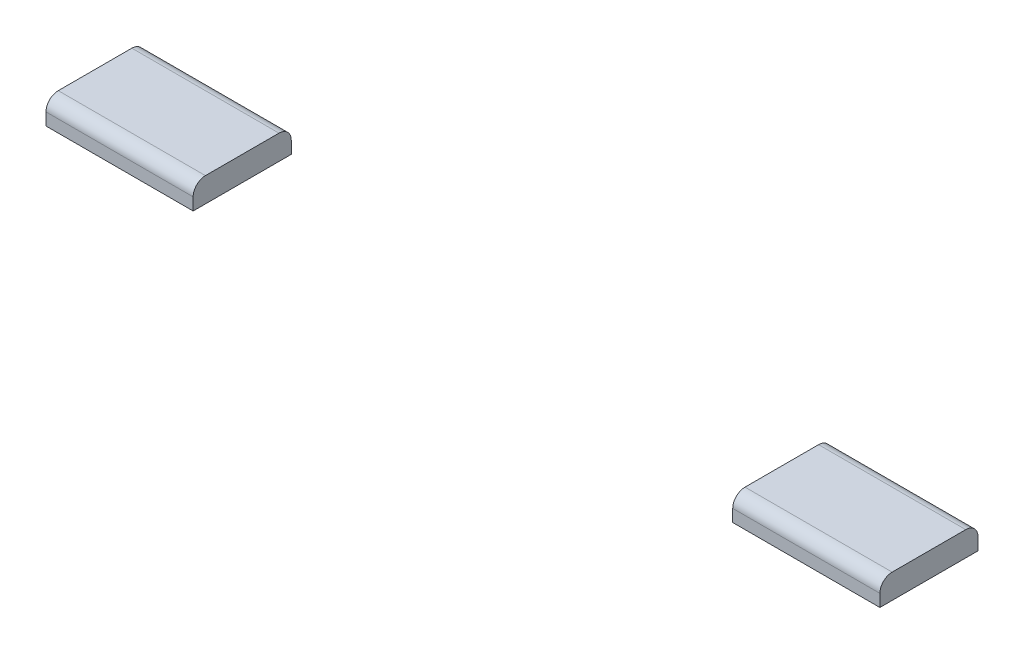
ISO-10303-21;
HEADER;
FILE_DESCRIPTION(('STEP AP214'),'2;1');
FILE_NAME('part.step','',(''),(''),'','','');
FILE_SCHEMA(('AUTOMOTIVE_DESIGN { 1 0 10303 214 1 1 1 1 }'));
ENDSEC;
DATA;
#1=APPLICATION_CONTEXT('core data for automotive mechanical design processes');
#2=APPLICATION_PROTOCOL_DEFINITION('international standard','automotive_design',2000,#1);
#3=PRODUCT_CONTEXT('',#1,'mechanical');
#4=PRODUCT('Part','Part','',(#3));
#5=PRODUCT_RELATED_PRODUCT_CATEGORY('part','',(#4));
#6=PRODUCT_DEFINITION_FORMATION('','',#4);
#7=PRODUCT_DEFINITION_CONTEXT('part definition',#1,'design');
#8=PRODUCT_DEFINITION('design','',#6,#7);
#9=PRODUCT_DEFINITION_SHAPE('','',#8);
#10=(LENGTH_UNIT() NAMED_UNIT(*) SI_UNIT(.MILLI.,.METRE.));
#11=(NAMED_UNIT(*) PLANE_ANGLE_UNIT() SI_UNIT($,.RADIAN.));
#12=(NAMED_UNIT(*) SI_UNIT($,.STERADIAN.) SOLID_ANGLE_UNIT());
#13=UNCERTAINTY_MEASURE_WITH_UNIT(LENGTH_MEASURE(1.E-05),#10,'distance_accuracy_value','');
#14=(GEOMETRIC_REPRESENTATION_CONTEXT(3) GLOBAL_UNCERTAINTY_ASSIGNED_CONTEXT((#13)) GLOBAL_UNIT_ASSIGNED_CONTEXT((#10,
#11,#12)) REPRESENTATION_CONTEXT('',''));
#15=CARTESIAN_POINT('',(0.,0.,0.));
#16=DIRECTION('',(0.,0.,1.));
#17=DIRECTION('',(1.,0.,0.));
#18=AXIS2_PLACEMENT_3D('',#15,#16,#17);
#19=CARTESIAN_POINT('',(0.,6.35,0.));
#20=DIRECTION('',(0.,0.,-1.));
#21=DIRECTION('',(-1.,0.,0.));
#22=AXIS2_PLACEMENT_3D('',#19,#20,#21);
#23=PLANE('',#22);
#24=DIRECTION('',(1.,0.,0.));
#25=VECTOR('',#24,1.);
#26=CARTESIAN_POINT('',(0.,0.,0.));
#27=LINE('',#26,#25);
#28=CARTESIAN_POINT('',(0.,0.,0.));
#29=VERTEX_POINT('',#28);
#30=CARTESIAN_POINT('',(38.1,0.,0.));
#31=VERTEX_POINT('',#30);
#32=EDGE_CURVE('E45',#29,#31,#27,.T.);
#33=ORIENTED_EDGE('',*,*,#32,.T.);
#34=DIRECTION('',(0.,-1.,0.));
#35=VECTOR('',#34,1.);
#36=CARTESIAN_POINT('',(38.1,6.35,0.));
#37=LINE('',#36,#35);
#38=CARTESIAN_POINT('',(38.1,3.175,0.));
#39=VERTEX_POINT('',#38);
#40=EDGE_CURVE('E51',#39,#31,#37,.T.);
#41=ORIENTED_EDGE('',*,*,#40,.F.);
#42=DIRECTION('',(1.,0.,0.));
#43=VECTOR('',#42,1.);
#44=CARTESIAN_POINT('',(0.,3.175,0.));
#45=LINE('',#44,#43);
#46=CARTESIAN_POINT('',(0.,3.175,0.));
#47=VERTEX_POINT('',#46);
#48=EDGE_CURVE('E94',#39,#47,#45,.F.);
#49=ORIENTED_EDGE('',*,*,#48,.T.);
#50=DIRECTION('',(0.,-1.,0.));
#51=VECTOR('',#50,1.);
#52=CARTESIAN_POINT('',(0.,6.35,0.));
#53=LINE('',#52,#51);
#54=EDGE_CURVE('E93',#47,#29,#53,.T.);
#55=ORIENTED_EDGE('',*,*,#54,.T.);
#56=EDGE_LOOP('',(#33,#41,#49,#55));
#57=FACE_BOUND('',#56,.T.);
#58=ADVANCED_FACE('F42',(#57),#23,.F.);
#59=CARTESIAN_POINT('',(0.,6.35,-25.4));
#60=DIRECTION('',(0.,0.,1.));
#61=DIRECTION('',(1.,0.,0.));
#62=AXIS2_PLACEMENT_3D('',#59,#60,#61);
#63=PLANE('',#62);
#64=DIRECTION('',(-1.,0.,0.));
#65=VECTOR('',#64,1.);
#66=CARTESIAN_POINT('',(0.,3.175,-25.4));
#67=LINE('',#66,#65);
#68=CARTESIAN_POINT('',(0.,3.175,-25.4));
#69=VERTEX_POINT('',#68);
#70=CARTESIAN_POINT('',(38.1,3.175,-25.4));
#71=VERTEX_POINT('',#70);
#72=EDGE_CURVE('E97',#69,#71,#67,.F.);
#73=ORIENTED_EDGE('',*,*,#72,.T.);
#74=DIRECTION('',(0.,-1.,0.));
#75=VECTOR('',#74,1.);
#76=CARTESIAN_POINT('',(38.1,6.35,-25.4));
#77=LINE('',#76,#75);
#78=CARTESIAN_POINT('',(38.1,0.,-25.4));
#79=VERTEX_POINT('',#78);
#80=EDGE_CURVE('E58',#71,#79,#77,.T.);
#81=ORIENTED_EDGE('',*,*,#80,.T.);
#82=DIRECTION('',(-1.,0.,0.));
#83=VECTOR('',#82,1.);
#84=CARTESIAN_POINT('',(0.,0.,-25.4));
#85=LINE('',#84,#83);
#86=CARTESIAN_POINT('',(0.,0.,-25.4));
#87=VERTEX_POINT('',#86);
#88=EDGE_CURVE('E90',#79,#87,#85,.T.);
#89=ORIENTED_EDGE('',*,*,#88,.T.);
#90=DIRECTION('',(0.,-1.,0.));
#91=VECTOR('',#90,1.);
#92=CARTESIAN_POINT('',(0.,6.35,-25.4));
#93=LINE('',#92,#91);
#94=EDGE_CURVE('E124',#69,#87,#93,.T.);
#95=ORIENTED_EDGE('',*,*,#94,.F.);
#96=EDGE_LOOP('',(#73,#81,#89,#95));
#97=FACE_BOUND('',#96,.T.);
#98=ADVANCED_FACE('F140',(#97),#63,.F.);
#99=CARTESIAN_POINT('',(0.,6.35,0.));
#100=DIRECTION('',(0.,-1.,0.));
#101=DIRECTION('',(0.,0.,-1.));
#102=AXIS2_PLACEMENT_3D('',#99,#100,#101);
#103=PLANE('',#102);
#104=DIRECTION('',(1.,0.,0.));
#105=VECTOR('',#104,1.);
#106=CARTESIAN_POINT('',(0.,6.35,-3.175));
#107=LINE('',#106,#105);
#108=CARTESIAN_POINT('',(0.,6.35,-3.175));
#109=VERTEX_POINT('',#108);
#110=CARTESIAN_POINT('',(38.1,6.35,-3.175));
#111=VERTEX_POINT('',#110);
#112=EDGE_CURVE('E108',#109,#111,#107,.T.);
#113=ORIENTED_EDGE('',*,*,#112,.T.);
#114=DIRECTION('',(0.,0.,-1.));
#115=VECTOR('',#114,1.);
#116=CARTESIAN_POINT('',(38.1,6.35,0.));
#117=LINE('',#116,#115);
#118=CARTESIAN_POINT('',(38.1,6.35,-22.225));
#119=VERTEX_POINT('',#118);
#120=EDGE_CURVE('E101',#111,#119,#117,.T.);
#121=ORIENTED_EDGE('',*,*,#120,.T.);
#122=DIRECTION('',(-1.,0.,0.));
#123=VECTOR('',#122,1.);
#124=CARTESIAN_POINT('',(0.,6.35,-22.225));
#125=LINE('',#124,#123);
#126=CARTESIAN_POINT('',(0.,6.35,-22.225));
#127=VERTEX_POINT('',#126);
#128=EDGE_CURVE('E104',#119,#127,#125,.T.);
#129=ORIENTED_EDGE('',*,*,#128,.T.);
#130=DIRECTION('',(0.,0.,1.));
#131=VECTOR('',#130,1.);
#132=CARTESIAN_POINT('',(0.,6.35,0.));
#133=LINE('',#132,#131);
#134=EDGE_CURVE('E107',#127,#109,#133,.T.);
#135=ORIENTED_EDGE('',*,*,#134,.T.);
#136=EDGE_LOOP('',(#113,#121,#129,#135));
#137=FACE_BOUND('',#136,.T.);
#138=ADVANCED_FACE('F144',(#137),#103,.F.);
#139=CARTESIAN_POINT('',(0.,0.,0.));
#140=DIRECTION('',(0.,-1.,0.));
#141=DIRECTION('',(0.,0.,-1.));
#142=AXIS2_PLACEMENT_3D('',#139,#140,#141);
#143=PLANE('',#142);
#144=DIRECTION('',(0.,0.,-1.));
#145=VECTOR('',#144,1.);
#146=CARTESIAN_POINT('',(38.1,0.,0.));
#147=LINE('',#146,#145);
#148=EDGE_CURVE('E12',#31,#79,#147,.T.);
#149=ORIENTED_EDGE('',*,*,#148,.F.);
#150=ORIENTED_EDGE('',*,*,#32,.F.);
#151=DIRECTION('',(0.,0.,1.));
#152=VECTOR('',#151,1.);
#153=CARTESIAN_POINT('',(0.,0.,0.));
#154=LINE('',#153,#152);
#155=EDGE_CURVE('E122',#87,#29,#154,.T.);
#156=ORIENTED_EDGE('',*,*,#155,.F.);
#157=ORIENTED_EDGE('',*,*,#88,.F.);
#158=EDGE_LOOP('',(#149,#150,#156,#157));
#159=FACE_BOUND('',#158,.T.);
#160=ADVANCED_FACE('F86',(#159),#143,.T.);
#161=CARTESIAN_POINT('',(0.,3.175,-22.225));
#162=DIRECTION('',(-1.,0.,0.));
#163=DIRECTION('',(0.,0.,1.));
#164=AXIS2_PLACEMENT_3D('',#161,#162,#163);
#165=CYLINDRICAL_SURFACE('',#164,3.175);
#166=CARTESIAN_POINT('',(38.1,3.175,-22.225));
#167=DIRECTION('',(-1.,0.,0.));
#168=DIRECTION('',(0.,0.,1.));
#169=AXIS2_PLACEMENT_3D('',#166,#167,#168);
#170=CIRCLE('',#169,3.175);
#171=EDGE_CURVE('E116',#71,#119,#170,.F.);
#172=ORIENTED_EDGE('',*,*,#171,.F.);
#173=ORIENTED_EDGE('',*,*,#72,.F.);
#174=CARTESIAN_POINT('',(0.,3.175,-22.225));
#175=DIRECTION('',(1.,0.,0.));
#176=DIRECTION('',(0.,0.,-1.));
#177=AXIS2_PLACEMENT_3D('',#174,#175,#176);
#178=CIRCLE('',#177,3.175);
#179=EDGE_CURVE('E121',#127,#69,#178,.F.);
#180=ORIENTED_EDGE('',*,*,#179,.F.);
#181=ORIENTED_EDGE('',*,*,#128,.F.);
#182=EDGE_LOOP('',(#172,#173,#180,#181));
#183=FACE_BOUND('',#182,.T.);
#184=ADVANCED_FACE('F141',(#183),#165,.T.);
#185=CARTESIAN_POINT('',(0.,3.175,-3.175));
#186=DIRECTION('',(1.,0.,0.));
#187=DIRECTION('',(0.,0.,-1.));
#188=AXIS2_PLACEMENT_3D('',#185,#186,#187);
#189=CYLINDRICAL_SURFACE('',#188,3.175);
#190=CARTESIAN_POINT('',(38.1,3.175,-3.175));
#191=DIRECTION('',(-1.,0.,0.));
#192=DIRECTION('',(0.,0.,1.));
#193=AXIS2_PLACEMENT_3D('',#190,#191,#192);
#194=CIRCLE('',#193,3.175);
#195=EDGE_CURVE('E77',#111,#39,#194,.F.);
#196=ORIENTED_EDGE('',*,*,#195,.F.);
#197=ORIENTED_EDGE('',*,*,#112,.F.);
#198=CARTESIAN_POINT('',(0.,3.175,-3.175));
#199=DIRECTION('',(1.,0.,0.));
#200=DIRECTION('',(0.,0.,-1.));
#201=AXIS2_PLACEMENT_3D('',#198,#199,#200);
#202=CIRCLE('',#201,3.175);
#203=EDGE_CURVE('E118',#47,#109,#202,.F.);
#204=ORIENTED_EDGE('',*,*,#203,.F.);
#205=ORIENTED_EDGE('',*,*,#48,.F.);
#206=EDGE_LOOP('',(#196,#197,#204,#205));
#207=FACE_BOUND('',#206,.T.);
#208=ADVANCED_FACE('F149',(#207),#189,.T.);
#209=CARTESIAN_POINT('',(0.,6.35,0.));
#210=DIRECTION('',(1.,0.,0.));
#211=DIRECTION('',(0.,0.,-1.));
#212=AXIS2_PLACEMENT_3D('',#209,#210,#211);
#213=PLANE('',#212);
#214=ORIENTED_EDGE('',*,*,#134,.F.);
#215=ORIENTED_EDGE('',*,*,#179,.T.);
#216=ORIENTED_EDGE('',*,*,#94,.T.);
#217=ORIENTED_EDGE('',*,*,#155,.T.);
#218=ORIENTED_EDGE('',*,*,#54,.F.);
#219=ORIENTED_EDGE('',*,*,#203,.T.);
#220=EDGE_LOOP('',(#214,#215,#216,#217,#218,#219));
#221=FACE_BOUND('',#220,.T.);
#222=ADVANCED_FACE('F134',(#221),#213,.F.);
#223=CARTESIAN_POINT('',(38.1,6.35,0.));
#224=DIRECTION('',(-1.,0.,0.));
#225=DIRECTION('',(0.,0.,1.));
#226=AXIS2_PLACEMENT_3D('',#223,#224,#225);
#227=PLANE('',#226);
#228=ORIENTED_EDGE('',*,*,#171,.T.);
#229=ORIENTED_EDGE('',*,*,#120,.F.);
#230=ORIENTED_EDGE('',*,*,#195,.T.);
#231=ORIENTED_EDGE('',*,*,#40,.T.);
#232=ORIENTED_EDGE('',*,*,#148,.T.);
#233=ORIENTED_EDGE('',*,*,#80,.F.);
#234=EDGE_LOOP('',(#228,#229,#230,#231,#232,#233));
#235=FACE_BOUND('',#234,.T.);
#236=ADVANCED_FACE('F74',(#235),#227,.F.);
#237=CLOSED_SHELL('',(#58,#98,#138,#160,#184,#208,#222,#236));
#238=MANIFOLD_SOLID_BREP('B2',#237);
#239=CARTESIAN_POINT('',(215.9,6.35,0.));
#240=DIRECTION('',(-1.,0.,0.));
#241=DIRECTION('',(0.,0.,1.));
#242=AXIS2_PLACEMENT_3D('',#239,#240,#241);
#243=PLANE('',#242);
#244=DIRECTION('',(0.,-1.,0.));
#245=VECTOR('',#244,1.);
#246=CARTESIAN_POINT('',(215.9,6.35,-25.4));
#247=LINE('',#246,#245);
#248=CARTESIAN_POINT('',(215.9,3.175,-25.4));
#249=VERTEX_POINT('',#248);
#250=CARTESIAN_POINT('',(215.9,0.,-25.4));
#251=VERTEX_POINT('',#250);
#252=EDGE_CURVE('E290',#249,#251,#247,.T.);
#253=ORIENTED_EDGE('',*,*,#252,.F.);
#254=CARTESIAN_POINT('',(215.9,3.175,-22.225));
#255=DIRECTION('',(-1.,0.,0.));
#256=DIRECTION('',(0.,0.,1.));
#257=AXIS2_PLACEMENT_3D('',#254,#255,#256);
#258=CIRCLE('',#257,3.175);
#259=CARTESIAN_POINT('',(215.9,6.35,-22.225));
#260=VERTEX_POINT('',#259);
#261=EDGE_CURVE('E311',#249,#260,#258,.F.);
#262=ORIENTED_EDGE('',*,*,#261,.T.);
#263=DIRECTION('',(0.,0.,-1.));
#264=VECTOR('',#263,1.);
#265=CARTESIAN_POINT('',(215.9,6.35,0.));
#266=LINE('',#265,#264);
#267=CARTESIAN_POINT('',(215.9,6.35,-3.175));
#268=VERTEX_POINT('',#267);
#269=EDGE_CURVE('E292',#268,#260,#266,.T.);
#270=ORIENTED_EDGE('',*,*,#269,.F.);
#271=CARTESIAN_POINT('',(215.9,3.175,-3.175));
#272=DIRECTION('',(-1.,0.,0.));
#273=DIRECTION('',(0.,0.,1.));
#274=AXIS2_PLACEMENT_3D('',#271,#272,#273);
#275=CIRCLE('',#274,3.175);
#276=CARTESIAN_POINT('',(215.9,3.175,0.));
#277=VERTEX_POINT('',#276);
#278=EDGE_CURVE('E239',#268,#277,#275,.F.);
#279=ORIENTED_EDGE('',*,*,#278,.T.);
#280=DIRECTION('',(0.,-1.,0.));
#281=VECTOR('',#280,1.);
#282=CARTESIAN_POINT('',(215.9,6.35,0.));
#283=LINE('',#282,#281);
#284=CARTESIAN_POINT('',(215.9,0.,0.));
#285=VERTEX_POINT('',#284);
#286=EDGE_CURVE('E301',#277,#285,#283,.T.);
#287=ORIENTED_EDGE('',*,*,#286,.T.);
#288=DIRECTION('',(0.,0.,-1.));
#289=VECTOR('',#288,1.);
#290=CARTESIAN_POINT('',(215.9,0.,0.));
#291=LINE('',#290,#289);
#292=EDGE_CURVE('E293',#285,#251,#291,.T.);
#293=ORIENTED_EDGE('',*,*,#292,.T.);
#294=EDGE_LOOP('',(#253,#262,#270,#279,#287,#293));
#295=FACE_BOUND('',#294,.T.);
#296=ADVANCED_FACE('F217',(#295),#243,.F.);
#297=CARTESIAN_POINT('',(0.,3.175,-3.175));
#298=DIRECTION('',(1.,0.,0.));
#299=DIRECTION('',(0.,0.,-1.));
#300=AXIS2_PLACEMENT_3D('',#297,#298,#299);
#301=CYLINDRICAL_SURFACE('',#300,3.175);
#302=CARTESIAN_POINT('',(177.8,3.175,-3.175));
#303=DIRECTION('',(1.,0.,0.));
#304=DIRECTION('',(0.,0.,-1.));
#305=AXIS2_PLACEMENT_3D('',#302,#303,#304);
#306=CIRCLE('',#305,3.175);
#307=CARTESIAN_POINT('',(177.8,3.175,0.));
#308=VERTEX_POINT('',#307);
#309=CARTESIAN_POINT('',(177.8,6.35,-3.175));
#310=VERTEX_POINT('',#309);
#311=EDGE_CURVE('E40',#308,#310,#306,.F.);
#312=ORIENTED_EDGE('',*,*,#311,.F.);
#313=DIRECTION('',(1.,0.,0.));
#314=VECTOR('',#313,1.);
#315=CARTESIAN_POINT('',(0.,3.175,0.));
#316=LINE('',#315,#314);
#317=EDGE_CURVE('E225',#277,#308,#316,.F.);
#318=ORIENTED_EDGE('',*,*,#317,.F.);
#319=ORIENTED_EDGE('',*,*,#278,.F.);
#320=DIRECTION('',(1.,0.,0.));
#321=VECTOR('',#320,1.);
#322=CARTESIAN_POINT('',(0.,6.35,-3.175));
#323=LINE('',#322,#321);
#324=EDGE_CURVE('E303',#310,#268,#323,.T.);
#325=ORIENTED_EDGE('',*,*,#324,.F.);
#326=EDGE_LOOP('',(#312,#318,#319,#325));
#327=FACE_BOUND('',#326,.T.);
#328=ADVANCED_FACE('F219',(#327),#301,.T.);
#329=CARTESIAN_POINT('',(0.,3.175,-22.225));
#330=DIRECTION('',(-1.,0.,0.));
#331=DIRECTION('',(0.,0.,1.));
#332=AXIS2_PLACEMENT_3D('',#329,#330,#331);
#333=CYLINDRICAL_SURFACE('',#332,3.175);
#334=CARTESIAN_POINT('',(177.8,3.175,-22.225));
#335=DIRECTION('',(1.,0.,0.));
#336=DIRECTION('',(0.,0.,-1.));
#337=AXIS2_PLACEMENT_3D('',#334,#335,#336);
#338=CIRCLE('',#337,3.175);
#339=CARTESIAN_POINT('',(177.8,6.35,-22.225));
#340=VERTEX_POINT('',#339);
#341=CARTESIAN_POINT('',(177.8,3.175,-25.4));
#342=VERTEX_POINT('',#341);
#343=EDGE_CURVE('E274',#340,#342,#338,.F.);
#344=ORIENTED_EDGE('',*,*,#343,.F.);
#345=DIRECTION('',(-1.,0.,0.));
#346=VECTOR('',#345,1.);
#347=CARTESIAN_POINT('',(0.,6.35,-22.225));
#348=LINE('',#347,#346);
#349=EDGE_CURVE('E305',#260,#340,#348,.T.);
#350=ORIENTED_EDGE('',*,*,#349,.F.);
#351=ORIENTED_EDGE('',*,*,#261,.F.);
#352=DIRECTION('',(-1.,0.,0.));
#353=VECTOR('',#352,1.);
#354=CARTESIAN_POINT('',(0.,3.175,-25.4));
#355=LINE('',#354,#353);
#356=EDGE_CURVE('E308',#342,#249,#355,.F.);
#357=ORIENTED_EDGE('',*,*,#356,.F.);
#358=EDGE_LOOP('',(#344,#350,#351,#357));
#359=FACE_BOUND('',#358,.T.);
#360=ADVANCED_FACE('F327',(#359),#333,.T.);
#361=CARTESIAN_POINT('',(0.,6.35,0.));
#362=DIRECTION('',(0.,-1.,0.));
#363=DIRECTION('',(0.,0.,-1.));
#364=AXIS2_PLACEMENT_3D('',#361,#362,#363);
#365=PLANE('',#364);
#366=ORIENTED_EDGE('',*,*,#349,.T.);
#367=DIRECTION('',(0.,0.,1.));
#368=VECTOR('',#367,1.);
#369=CARTESIAN_POINT('',(177.8,6.35,0.));
#370=LINE('',#369,#368);
#371=EDGE_CURVE('E278',#340,#310,#370,.T.);
#372=ORIENTED_EDGE('',*,*,#371,.T.);
#373=ORIENTED_EDGE('',*,*,#324,.T.);
#374=ORIENTED_EDGE('',*,*,#269,.T.);
#375=EDGE_LOOP('',(#366,#372,#373,#374));
#376=FACE_BOUND('',#375,.T.);
#377=ADVANCED_FACE('F320',(#376),#365,.F.);
#378=CARTESIAN_POINT('',(0.,0.,0.));
#379=DIRECTION('',(0.,-1.,0.));
#380=DIRECTION('',(0.,0.,-1.));
#381=AXIS2_PLACEMENT_3D('',#378,#379,#380);
#382=PLANE('',#381);
#383=DIRECTION('',(0.,0.,1.));
#384=VECTOR('',#383,1.);
#385=CARTESIAN_POINT('',(177.8,0.,0.));
#386=LINE('',#385,#384);
#387=CARTESIAN_POINT('',(177.8,0.,-25.4));
#388=VERTEX_POINT('',#387);
#389=CARTESIAN_POINT('',(177.8,0.,0.));
#390=VERTEX_POINT('',#389);
#391=EDGE_CURVE('E272',#388,#390,#386,.T.);
#392=ORIENTED_EDGE('',*,*,#391,.F.);
#393=DIRECTION('',(-1.,0.,0.));
#394=VECTOR('',#393,1.);
#395=CARTESIAN_POINT('',(0.,0.,-25.4));
#396=LINE('',#395,#394);
#397=EDGE_CURVE('E285',#251,#388,#396,.T.);
#398=ORIENTED_EDGE('',*,*,#397,.F.);
#399=ORIENTED_EDGE('',*,*,#292,.F.);
#400=DIRECTION('',(1.,0.,0.));
#401=VECTOR('',#400,1.);
#402=CARTESIAN_POINT('',(0.,0.,0.));
#403=LINE('',#402,#401);
#404=EDGE_CURVE('E286',#390,#285,#403,.T.);
#405=ORIENTED_EDGE('',*,*,#404,.F.);
#406=EDGE_LOOP('',(#392,#398,#399,#405));
#407=FACE_BOUND('',#406,.T.);
#408=ADVANCED_FACE('F283',(#407),#382,.T.);
#409=CARTESIAN_POINT('',(0.,6.35,-25.4));
#410=DIRECTION('',(0.,0.,1.));
#411=DIRECTION('',(1.,0.,0.));
#412=AXIS2_PLACEMENT_3D('',#409,#410,#411);
#413=PLANE('',#412);
#414=ORIENTED_EDGE('',*,*,#397,.T.);
#415=DIRECTION('',(0.,-1.,0.));
#416=VECTOR('',#415,1.);
#417=CARTESIAN_POINT('',(177.8,6.35,-25.4));
#418=LINE('',#417,#416);
#419=EDGE_CURVE('E269',#342,#388,#418,.T.);
#420=ORIENTED_EDGE('',*,*,#419,.F.);
#421=ORIENTED_EDGE('',*,*,#356,.T.);
#422=ORIENTED_EDGE('',*,*,#252,.T.);
#423=EDGE_LOOP('',(#414,#420,#421,#422));
#424=FACE_BOUND('',#423,.T.);
#425=ADVANCED_FACE('F288',(#424),#413,.F.);
#426=CARTESIAN_POINT('',(0.,6.35,0.));
#427=DIRECTION('',(0.,0.,-1.));
#428=DIRECTION('',(-1.,0.,0.));
#429=AXIS2_PLACEMENT_3D('',#426,#427,#428);
#430=PLANE('',#429);
#431=ORIENTED_EDGE('',*,*,#317,.T.);
#432=DIRECTION('',(0.,-1.,0.));
#433=VECTOR('',#432,1.);
#434=CARTESIAN_POINT('',(177.8,6.35,0.));
#435=LINE('',#434,#433);
#436=EDGE_CURVE('E231',#308,#390,#435,.T.);
#437=ORIENTED_EDGE('',*,*,#436,.T.);
#438=ORIENTED_EDGE('',*,*,#404,.T.);
#439=ORIENTED_EDGE('',*,*,#286,.F.);
#440=EDGE_LOOP('',(#431,#437,#438,#439));
#441=FACE_BOUND('',#440,.T.);
#442=ADVANCED_FACE('F315',(#441),#430,.F.);
#443=CARTESIAN_POINT('',(177.8,6.35,0.));
#444=DIRECTION('',(1.,0.,0.));
#445=DIRECTION('',(0.,0.,-1.));
#446=AXIS2_PLACEMENT_3D('',#443,#444,#445);
#447=PLANE('',#446);
#448=ORIENTED_EDGE('',*,*,#343,.T.);
#449=ORIENTED_EDGE('',*,*,#419,.T.);
#450=ORIENTED_EDGE('',*,*,#391,.T.);
#451=ORIENTED_EDGE('',*,*,#436,.F.);
#452=ORIENTED_EDGE('',*,*,#311,.T.);
#453=ORIENTED_EDGE('',*,*,#371,.F.);
#454=EDGE_LOOP('',(#448,#449,#450,#451,#452,#453));
#455=FACE_BOUND('',#454,.T.);
#456=ADVANCED_FACE('F271',(#455),#447,.F.);
#457=CLOSED_SHELL('',(#296,#328,#360,#377,#408,#425,#442,#456));
#458=MANIFOLD_SOLID_BREP('B6',#457);
#459=ADVANCED_BREP_SHAPE_REPRESENTATION('',(#18,#238,#458),#14);
#460=SHAPE_DEFINITION_REPRESENTATION(#9,#459);
ENDSEC;
END-ISO-10303-21;
